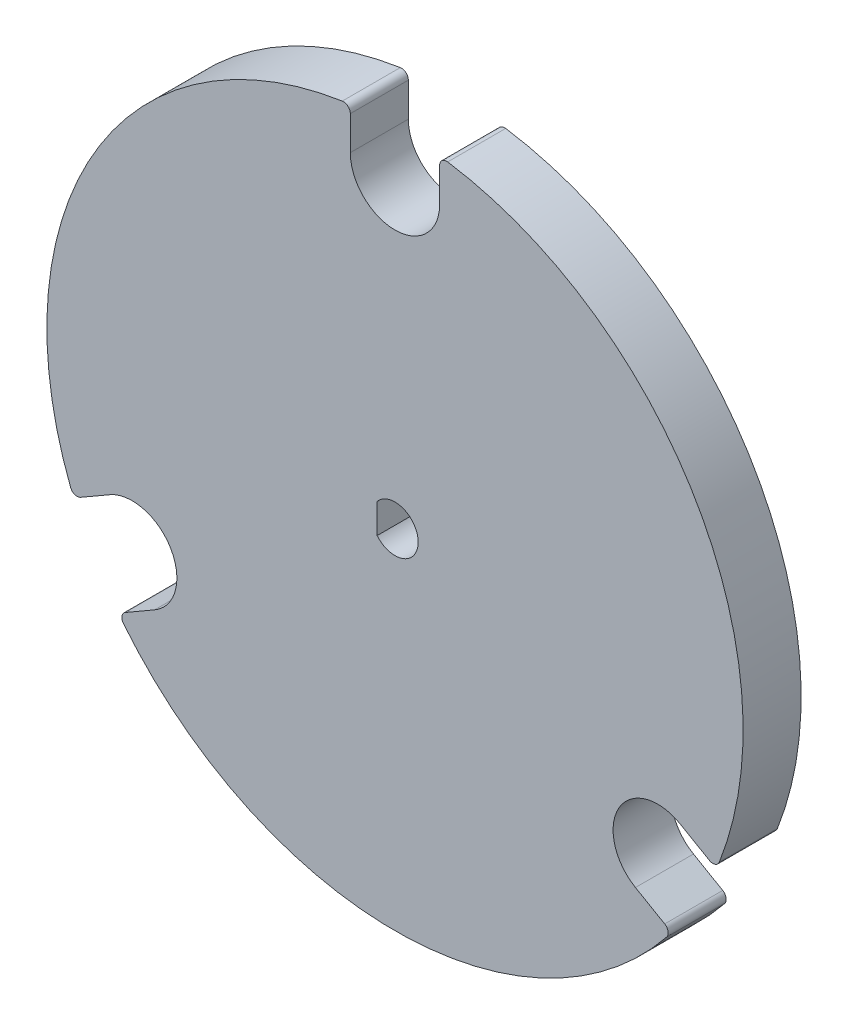
ISO-10303-21;
HEADER;
FILE_DESCRIPTION(('STEP AP214'),'2;1');
FILE_NAME('part.step','',(''),(''),'','','');
FILE_SCHEMA(('AUTOMOTIVE_DESIGN { 1 0 10303 214 1 1 1 1 }'));
ENDSEC;
DATA;
#1=APPLICATION_CONTEXT('core data for automotive mechanical design processes');
#2=APPLICATION_PROTOCOL_DEFINITION('international standard','automotive_design',2000,#1);
#3=PRODUCT_CONTEXT('',#1,'mechanical');
#4=PRODUCT('Part','Part','',(#3));
#5=PRODUCT_RELATED_PRODUCT_CATEGORY('part','',(#4));
#6=PRODUCT_DEFINITION_FORMATION('','',#4);
#7=PRODUCT_DEFINITION_CONTEXT('part definition',#1,'design');
#8=PRODUCT_DEFINITION('design','',#6,#7);
#9=PRODUCT_DEFINITION_SHAPE('','',#8);
#10=(LENGTH_UNIT() NAMED_UNIT(*) SI_UNIT(.MILLI.,.METRE.));
#11=(NAMED_UNIT(*) PLANE_ANGLE_UNIT() SI_UNIT($,.RADIAN.));
#12=(NAMED_UNIT(*) SI_UNIT($,.STERADIAN.) SOLID_ANGLE_UNIT());
#13=UNCERTAINTY_MEASURE_WITH_UNIT(LENGTH_MEASURE(1.E-05),#10,'distance_accuracy_value','');
#14=(GEOMETRIC_REPRESENTATION_CONTEXT(3) GLOBAL_UNCERTAINTY_ASSIGNED_CONTEXT((#13)) GLOBAL_UNIT_ASSIGNED_CONTEXT((#10,
#11,#12)) REPRESENTATION_CONTEXT('',''));
#15=CARTESIAN_POINT('',(0.,0.,0.));
#16=DIRECTION('',(0.,0.,1.));
#17=DIRECTION('',(1.,0.,0.));
#18=AXIS2_PLACEMENT_3D('',#15,#16,#17);
#19=CARTESIAN_POINT('',(0.,0.,6.35));
#20=DIRECTION('',(0.,0.,-1.));
#21=DIRECTION('',(-1.,0.,0.));
#22=AXIS2_PLACEMENT_3D('',#19,#20,#21);
#23=CYLINDRICAL_SURFACE('',#22,38.1);
#24=CARTESIAN_POINT('',(0.,0.,6.35));
#25=DIRECTION('',(0.,0.,1.));
#26=DIRECTION('',(1.,0.,0.));
#27=AXIS2_PLACEMENT_3D('',#24,#25,#26);
#28=CIRCLE('',#27,38.1);
#29=CARTESIAN_POINT('',(-5.76683673469387,37.6610354886239,6.35));
#30=VERTEX_POINT('',#29);
#31=CARTESIAN_POINT('',(-35.4988318333225,-13.8362906325897,6.35));
#32=VERTEX_POINT('',#31);
#33=EDGE_CURVE('E294',#30,#32,#28,.T.);
#34=ORIENTED_EDGE('',*,*,#33,.F.);
#35=DIRECTION('',(0.,0.,-1.));
#36=VECTOR('',#35,1.);
#37=CARTESIAN_POINT('',(-5.76683673469387,37.6610354886239,6.35));
#38=LINE('',#37,#36);
#39=CARTESIAN_POINT('',(-5.76683673469387,37.6610354886239,0.));
#40=VERTEX_POINT('',#39);
#41=EDGE_CURVE('E325',#30,#40,#38,.T.);
#42=ORIENTED_EDGE('',*,*,#41,.T.);
#43=CARTESIAN_POINT('',(0.,0.,0.));
#44=DIRECTION('',(0.,0.,1.));
#45=DIRECTION('',(1.,0.,0.));
#46=AXIS2_PLACEMENT_3D('',#43,#44,#45);
#47=CIRCLE('',#46,38.1);
#48=CARTESIAN_POINT('',(-35.4988318333225,-13.8362906325897,0.));
#49=VERTEX_POINT('',#48);
#50=EDGE_CURVE('E293',#40,#49,#47,.T.);
#51=ORIENTED_EDGE('',*,*,#50,.T.);
#52=DIRECTION('',(0.,0.,-1.));
#53=VECTOR('',#52,1.);
#54=CARTESIAN_POINT('',(-35.4988318333225,-13.8362906325897,6.35));
#55=LINE('',#54,#53);
#56=EDGE_CURVE('E321',#49,#32,#55,.F.);
#57=ORIENTED_EDGE('',*,*,#56,.T.);
#58=EDGE_LOOP('',(#34,#42,#51,#57));
#59=FACE_BOUND('',#58,.T.);
#60=ADVANCED_FACE('F39',(#59),#23,.T.);
#61=CARTESIAN_POINT('',(35.4988318333225,-13.8362906325897,0.));
#62=VERTEX_POINT('',#61);
#63=CARTESIAN_POINT('',(5.76683673469391,37.6610354886239,0.));
#64=VERTEX_POINT('',#63);
#65=EDGE_CURVE('E229',#62,#64,#47,.T.);
#66=ORIENTED_EDGE('',*,*,#65,.T.);
#67=DIRECTION('',(0.,0.,-1.));
#68=VECTOR('',#67,1.);
#69=CARTESIAN_POINT('',(5.76683673469391,37.6610354886239,6.35));
#70=LINE('',#69,#68);
#71=CARTESIAN_POINT('',(5.76683673469391,37.6610354886239,6.35));
#72=VERTEX_POINT('',#71);
#73=EDGE_CURVE('E349',#64,#72,#70,.F.);
#74=ORIENTED_EDGE('',*,*,#73,.T.);
#75=CARTESIAN_POINT('',(35.4988318333225,-13.8362906325897,6.35));
#76=VERTEX_POINT('',#75);
#77=EDGE_CURVE('E288',#76,#72,#28,.T.);
#78=ORIENTED_EDGE('',*,*,#77,.F.);
#79=DIRECTION('',(0.,0.,-1.));
#80=VECTOR('',#79,1.);
#81=CARTESIAN_POINT('',(35.4988318333225,-13.8362906325897,6.35));
#82=LINE('',#81,#80);
#83=EDGE_CURVE('E346',#76,#62,#82,.T.);
#84=ORIENTED_EDGE('',*,*,#83,.T.);
#85=EDGE_LOOP('',(#66,#74,#78,#84));
#86=FACE_BOUND('',#85,.T.);
#87=ADVANCED_FACE('F423',(#86),#23,.T.);
#88=CARTESIAN_POINT('',(-29.7319950986286,-23.8247448560341,6.35));
#89=VERTEX_POINT('',#88);
#90=CARTESIAN_POINT('',(29.7319950986286,-23.8247448560341,6.35));
#91=VERTEX_POINT('',#90);
#92=EDGE_CURVE('E292',#89,#91,#28,.T.);
#93=ORIENTED_EDGE('',*,*,#92,.F.);
#94=DIRECTION('',(0.,0.,-1.));
#95=VECTOR('',#94,1.);
#96=CARTESIAN_POINT('',(-29.7319950986286,-23.8247448560341,6.35));
#97=LINE('',#96,#95);
#98=CARTESIAN_POINT('',(-29.7319950986286,-23.8247448560341,0.));
#99=VERTEX_POINT('',#98);
#100=EDGE_CURVE('E364',#89,#99,#97,.T.);
#101=ORIENTED_EDGE('',*,*,#100,.T.);
#102=CARTESIAN_POINT('',(29.7319950986286,-23.8247448560341,0.));
#103=VERTEX_POINT('',#102);
#104=EDGE_CURVE('E295',#99,#103,#47,.T.);
#105=ORIENTED_EDGE('',*,*,#104,.T.);
#106=DIRECTION('',(0.,0.,-1.));
#107=VECTOR('',#106,1.);
#108=CARTESIAN_POINT('',(29.7319950986286,-23.8247448560341,6.35));
#109=LINE('',#108,#107);
#110=EDGE_CURVE('E360',#103,#91,#109,.F.);
#111=ORIENTED_EDGE('',*,*,#110,.T.);
#112=EDGE_LOOP('',(#93,#101,#105,#111));
#113=FACE_BOUND('',#112,.T.);
#114=ADVANCED_FACE('F385',(#113),#23,.T.);
#115=CARTESIAN_POINT('',(0.,0.,6.35));
#116=DIRECTION('',(0.,0.,1.));
#117=DIRECTION('',(1.,0.,0.));
#118=AXIS2_PLACEMENT_3D('',#115,#116,#117);
#119=PLANE('',#118);
#120=CARTESIAN_POINT('',(0.,0.,6.35));
#121=DIRECTION('',(0.,0.,1.));
#122=DIRECTION('',(1.,0.,0.));
#123=AXIS2_PLACEMENT_3D('',#120,#121,#122);
#124=CIRCLE('',#123,2.54);
#125=CARTESIAN_POINT('',(-1.9558,-1.62063146952045,6.35));
#126=VERTEX_POINT('',#125);
#127=CARTESIAN_POINT('',(-1.9558,1.62063146952045,6.35));
#128=VERTEX_POINT('',#127);
#129=EDGE_CURVE('E55',#126,#128,#124,.T.);
#130=ORIENTED_EDGE('',*,*,#129,.F.);
#131=DIRECTION('',(0.,-1.,0.));
#132=VECTOR('',#131,1.);
#133=CARTESIAN_POINT('',(-1.9558,-1.62063146952045,6.35));
#134=LINE('',#133,#132);
#135=EDGE_CURVE('E191',#128,#126,#134,.T.);
#136=ORIENTED_EDGE('',*,*,#135,.F.);
#137=EDGE_LOOP('',(#130,#136));
#138=FACE_BOUND('',#137,.T.);
#139=DIRECTION('',(0.,-1.,0.));
#140=VECTOR('',#139,1.);
#141=CARTESIAN_POINT('',(-4.88949999999999,33.2105,6.35));
#142=LINE('',#141,#140);
#143=CARTESIAN_POINT('',(-4.88949999999999,36.9078147788514,6.35));
#144=VERTEX_POINT('',#143);
#145=CARTESIAN_POINT('',(-4.88949999999999,33.2105,6.35));
#146=VERTEX_POINT('',#145);
#147=EDGE_CURVE('E206',#144,#146,#142,.T.);
#148=ORIENTED_EDGE('',*,*,#147,.F.);
#149=CARTESIAN_POINT('',(-5.65149999999999,36.9078147788514,6.35));
#150=DIRECTION('',(0.,0.,1.));
#151=DIRECTION('',(1.,0.,0.));
#152=AXIS2_PLACEMENT_3D('',#149,#150,#151);
#153=CIRCLE('',#152,0.762);
#154=EDGE_CURVE('E318',#144,#30,#153,.T.);
#155=ORIENTED_EDGE('',*,*,#154,.T.);
#156=ORIENTED_EDGE('',*,*,#33,.T.);
#157=CARTESIAN_POINT('',(-34.788855196656,-13.5595648199379,6.35));
#158=DIRECTION('',(0.,0.,1.));
#159=DIRECTION('',(1.,0.,0.));
#160=AXIS2_PLACEMENT_3D('',#157,#158,#159);
#161=CIRCLE('',#160,0.762);
#162=CARTESIAN_POINT('',(-34.407855196656,-14.2194761776217,6.35));
#163=VERTEX_POINT('',#162);
#164=EDGE_CURVE('E309',#32,#163,#161,.T.);
#165=ORIENTED_EDGE('',*,*,#164,.T.);
#166=DIRECTION('',(-0.866025403784438,-0.500000000000001,0.));
#167=VECTOR('',#166,1.);
#168=CARTESIAN_POINT('',(-31.2058866723831,-12.370818788196,6.35));
#169=LINE('',#168,#167);
#170=CARTESIAN_POINT('',(-31.2058866723831,-12.370818788196,6.35));
#171=VERTEX_POINT('',#170);
#172=EDGE_CURVE('E277',#171,#163,#169,.T.);
#173=ORIENTED_EDGE('',*,*,#172,.F.);
#174=CARTESIAN_POINT('',(-28.7611366723831,-16.60525,6.35));
#175=DIRECTION('',(0.,0.,1.));
#176=DIRECTION('',(1.,0.,0.));
#177=AXIS2_PLACEMENT_3D('',#174,#175,#176);
#178=CIRCLE('',#177,4.88950000000001);
#179=CARTESIAN_POINT('',(-26.3163866723831,-20.839681211804,6.35));
#180=VERTEX_POINT('',#179);
#181=EDGE_CURVE('E199',#180,#171,#178,.T.);
#182=ORIENTED_EDGE('',*,*,#181,.F.);
#183=DIRECTION('',(0.866025403784439,0.5,0.));
#184=VECTOR('',#183,1.);
#185=CARTESIAN_POINT('',(-26.3163866723831,-20.839681211804,6.35));
#186=LINE('',#185,#184);
#187=CARTESIAN_POINT('',(-29.518355196656,-22.6883386012297,6.35));
#188=VERTEX_POINT('',#187);
#189=EDGE_CURVE('E266',#188,#180,#186,.T.);
#190=ORIENTED_EDGE('',*,*,#189,.F.);
#191=CARTESIAN_POINT('',(-29.137355196656,-23.3482499589134,6.35));
#192=DIRECTION('',(0.,0.,1.));
#193=DIRECTION('',(1.,0.,0.));
#194=AXIS2_PLACEMENT_3D('',#191,#192,#193);
#195=CIRCLE('',#194,0.762);
#196=EDGE_CURVE('E312',#188,#89,#195,.T.);
#197=ORIENTED_EDGE('',*,*,#196,.T.);
#198=ORIENTED_EDGE('',*,*,#92,.T.);
#199=CARTESIAN_POINT('',(29.137355196656,-23.3482499589135,6.35));
#200=DIRECTION('',(0.,0.,1.));
#201=DIRECTION('',(1.,0.,0.));
#202=AXIS2_PLACEMENT_3D('',#199,#200,#201);
#203=CIRCLE('',#202,0.762);
#204=CARTESIAN_POINT('',(29.518355196656,-22.6883386012297,6.35));
#205=VERTEX_POINT('',#204);
#206=EDGE_CURVE('E306',#91,#205,#203,.T.);
#207=ORIENTED_EDGE('',*,*,#206,.T.);
#208=DIRECTION('',(0.866025403784439,-0.499999999999999,0.));
#209=VECTOR('',#208,1.);
#210=CARTESIAN_POINT('',(26.3163866723831,-20.839681211804,6.35));
#211=LINE('',#210,#209);
#212=CARTESIAN_POINT('',(26.3163866723831,-20.839681211804,6.35));
#213=VERTEX_POINT('',#212);
#214=EDGE_CURVE('E249',#213,#205,#211,.T.);
#215=ORIENTED_EDGE('',*,*,#214,.F.);
#216=CARTESIAN_POINT('',(28.7611366723831,-16.60525,6.35));
#217=DIRECTION('',(0.,0.,1.));
#218=DIRECTION('',(1.,0.,0.));
#219=AXIS2_PLACEMENT_3D('',#216,#217,#218);
#220=CIRCLE('',#219,4.88950000000001);
#221=CARTESIAN_POINT('',(31.2058866723831,-12.370818788196,6.35));
#222=VERTEX_POINT('',#221);
#223=EDGE_CURVE('E245',#222,#213,#220,.T.);
#224=ORIENTED_EDGE('',*,*,#223,.F.);
#225=DIRECTION('',(-0.866025403784439,0.499999999999999,0.));
#226=VECTOR('',#225,1.);
#227=CARTESIAN_POINT('',(31.2058866723831,-12.370818788196,6.35));
#228=LINE('',#227,#226);
#229=CARTESIAN_POINT('',(34.407855196656,-14.2194761776217,6.35));
#230=VERTEX_POINT('',#229);
#231=EDGE_CURVE('E237',#230,#222,#228,.T.);
#232=ORIENTED_EDGE('',*,*,#231,.F.);
#233=CARTESIAN_POINT('',(34.788855196656,-13.5595648199379,6.35));
#234=DIRECTION('',(0.,0.,1.));
#235=DIRECTION('',(1.,0.,0.));
#236=AXIS2_PLACEMENT_3D('',#233,#234,#235);
#237=CIRCLE('',#236,0.762);
#238=EDGE_CURVE('E303',#230,#76,#237,.T.);
#239=ORIENTED_EDGE('',*,*,#238,.T.);
#240=ORIENTED_EDGE('',*,*,#77,.T.);
#241=CARTESIAN_POINT('',(5.65150000000003,36.9078147788514,6.35));
#242=DIRECTION('',(0.,0.,1.));
#243=DIRECTION('',(1.,0.,0.));
#244=AXIS2_PLACEMENT_3D('',#241,#242,#243);
#245=CIRCLE('',#244,0.762);
#246=CARTESIAN_POINT('',(4.88950000000003,36.9078147788514,6.35));
#247=VERTEX_POINT('',#246);
#248=EDGE_CURVE('E315',#72,#247,#245,.T.);
#249=ORIENTED_EDGE('',*,*,#248,.T.);
#250=DIRECTION('',(0.,1.,0.));
#251=VECTOR('',#250,1.);
#252=CARTESIAN_POINT('',(4.88950000000003,33.2105,6.35));
#253=LINE('',#252,#251);
#254=CARTESIAN_POINT('',(4.88950000000003,33.2105,6.35));
#255=VERTEX_POINT('',#254);
#256=EDGE_CURVE('E218',#255,#247,#253,.T.);
#257=ORIENTED_EDGE('',*,*,#256,.F.);
#258=CARTESIAN_POINT('',(0.,33.2105,6.35));
#259=DIRECTION('',(0.,0.,1.));
#260=DIRECTION('',(1.,0.,0.));
#261=AXIS2_PLACEMENT_3D('',#258,#259,#260);
#262=CIRCLE('',#261,4.88950000000001);
#263=EDGE_CURVE('E214',#146,#255,#262,.T.);
#264=ORIENTED_EDGE('',*,*,#263,.F.);
#265=EDGE_LOOP('',(#148,#155,#156,#165,#173,#182,#190,#197,#198,#207,#215,#224,#232,#239,#240,
#249,#257,#264));
#266=FACE_BOUND('',#265,.T.);
#267=ADVANCED_FACE('F389',(#138,#266),#119,.T.);
#268=CARTESIAN_POINT('',(0.,0.,0.));
#269=DIRECTION('',(0.,0.,1.));
#270=DIRECTION('',(1.,0.,0.));
#271=AXIS2_PLACEMENT_3D('',#268,#269,#270);
#272=PLANE('',#271);
#273=DIRECTION('',(0.,-1.,0.));
#274=VECTOR('',#273,1.);
#275=CARTESIAN_POINT('',(-1.9558,-1.62063146952045,0.));
#276=LINE('',#275,#274);
#277=CARTESIAN_POINT('',(-1.9558,1.62063146952045,0.));
#278=VERTEX_POINT('',#277);
#279=CARTESIAN_POINT('',(-1.9558,-1.62063146952045,0.));
#280=VERTEX_POINT('',#279);
#281=EDGE_CURVE('E181',#278,#280,#276,.T.);
#282=ORIENTED_EDGE('',*,*,#281,.T.);
#283=CARTESIAN_POINT('',(0.,0.,0.));
#284=DIRECTION('',(0.,0.,1.));
#285=DIRECTION('',(1.,0.,0.));
#286=AXIS2_PLACEMENT_3D('',#283,#284,#285);
#287=CIRCLE('',#286,2.54);
#288=EDGE_CURVE('E60',#280,#278,#287,.T.);
#289=ORIENTED_EDGE('',*,*,#288,.T.);
#290=EDGE_LOOP('',(#282,#289));
#291=FACE_BOUND('',#290,.T.);
#292=ORIENTED_EDGE('',*,*,#50,.F.);
#293=CARTESIAN_POINT('',(-5.65149999999999,36.9078147788514,0.));
#294=DIRECTION('',(0.,0.,1.));
#295=DIRECTION('',(1.,0.,0.));
#296=AXIS2_PLACEMENT_3D('',#293,#294,#295);
#297=CIRCLE('',#296,0.762);
#298=CARTESIAN_POINT('',(-4.88949999999999,36.9078147788514,0.));
#299=VERTEX_POINT('',#298);
#300=EDGE_CURVE('E343',#40,#299,#297,.F.);
#301=ORIENTED_EDGE('',*,*,#300,.T.);
#302=DIRECTION('',(0.,-1.,0.));
#303=VECTOR('',#302,1.);
#304=CARTESIAN_POINT('',(-4.88949999999999,33.2105,0.));
#305=LINE('',#304,#303);
#306=CARTESIAN_POINT('',(-4.88949999999999,33.2105,0.));
#307=VERTEX_POINT('',#306);
#308=EDGE_CURVE('E210',#299,#307,#305,.T.);
#309=ORIENTED_EDGE('',*,*,#308,.T.);
#310=CARTESIAN_POINT('',(0.,33.2105,0.));
#311=DIRECTION('',(0.,0.,1.));
#312=DIRECTION('',(1.,0.,0.));
#313=AXIS2_PLACEMENT_3D('',#310,#311,#312);
#314=CIRCLE('',#313,4.88950000000001);
#315=CARTESIAN_POINT('',(4.88950000000003,33.2105,0.));
#316=VERTEX_POINT('',#315);
#317=EDGE_CURVE('E201',#307,#316,#314,.T.);
#318=ORIENTED_EDGE('',*,*,#317,.T.);
#319=DIRECTION('',(0.,1.,0.));
#320=VECTOR('',#319,1.);
#321=CARTESIAN_POINT('',(4.88950000000003,33.2105,0.));
#322=LINE('',#321,#320);
#323=CARTESIAN_POINT('',(4.88950000000003,36.9078147788514,0.));
#324=VERTEX_POINT('',#323);
#325=EDGE_CURVE('E205',#316,#324,#322,.T.);
#326=ORIENTED_EDGE('',*,*,#325,.T.);
#327=CARTESIAN_POINT('',(5.65150000000003,36.9078147788514,0.));
#328=DIRECTION('',(0.,0.,1.));
#329=DIRECTION('',(1.,0.,0.));
#330=AXIS2_PLACEMENT_3D('',#327,#328,#329);
#331=CIRCLE('',#330,0.762);
#332=EDGE_CURVE('E340',#324,#64,#331,.F.);
#333=ORIENTED_EDGE('',*,*,#332,.T.);
#334=ORIENTED_EDGE('',*,*,#65,.F.);
#335=CARTESIAN_POINT('',(34.788855196656,-13.5595648199379,0.));
#336=DIRECTION('',(0.,0.,1.));
#337=DIRECTION('',(1.,0.,0.));
#338=AXIS2_PLACEMENT_3D('',#335,#336,#337);
#339=CIRCLE('',#338,0.762);
#340=CARTESIAN_POINT('',(34.407855196656,-14.2194761776217,0.));
#341=VERTEX_POINT('',#340);
#342=EDGE_CURVE('E328',#62,#341,#339,.F.);
#343=ORIENTED_EDGE('',*,*,#342,.T.);
#344=DIRECTION('',(-0.866025403784439,0.499999999999999,0.));
#345=VECTOR('',#344,1.);
#346=CARTESIAN_POINT('',(31.2058866723831,-12.370818788196,0.));
#347=LINE('',#346,#345);
#348=CARTESIAN_POINT('',(31.2058866723831,-12.370818788196,0.));
#349=VERTEX_POINT('',#348);
#350=EDGE_CURVE('E241',#341,#349,#347,.T.);
#351=ORIENTED_EDGE('',*,*,#350,.T.);
#352=CARTESIAN_POINT('',(28.7611366723831,-16.60525,0.));
#353=DIRECTION('',(0.,0.,1.));
#354=DIRECTION('',(1.,0.,0.));
#355=AXIS2_PLACEMENT_3D('',#352,#353,#354);
#356=CIRCLE('',#355,4.88950000000001);
#357=CARTESIAN_POINT('',(26.3163866723831,-20.839681211804,0.));
#358=VERTEX_POINT('',#357);
#359=EDGE_CURVE('E232',#349,#358,#356,.T.);
#360=ORIENTED_EDGE('',*,*,#359,.T.);
#361=DIRECTION('',(0.866025403784439,-0.499999999999999,0.));
#362=VECTOR('',#361,1.);
#363=CARTESIAN_POINT('',(26.3163866723831,-20.839681211804,0.));
#364=LINE('',#363,#362);
#365=CARTESIAN_POINT('',(29.518355196656,-22.6883386012297,0.));
#366=VERTEX_POINT('',#365);
#367=EDGE_CURVE('E236',#358,#366,#364,.T.);
#368=ORIENTED_EDGE('',*,*,#367,.T.);
#369=CARTESIAN_POINT('',(29.137355196656,-23.3482499589135,0.));
#370=DIRECTION('',(0.,0.,1.));
#371=DIRECTION('',(1.,0.,0.));
#372=AXIS2_PLACEMENT_3D('',#369,#370,#371);
#373=CIRCLE('',#372,0.762);
#374=EDGE_CURVE('E331',#366,#103,#373,.F.);
#375=ORIENTED_EDGE('',*,*,#374,.T.);
#376=ORIENTED_EDGE('',*,*,#104,.F.);
#377=CARTESIAN_POINT('',(-29.137355196656,-23.3482499589134,0.));
#378=DIRECTION('',(0.,0.,1.));
#379=DIRECTION('',(1.,0.,0.));
#380=AXIS2_PLACEMENT_3D('',#377,#378,#379);
#381=CIRCLE('',#380,0.762);
#382=CARTESIAN_POINT('',(-29.518355196656,-22.6883386012297,0.));
#383=VERTEX_POINT('',#382);
#384=EDGE_CURVE('E337',#99,#383,#381,.F.);
#385=ORIENTED_EDGE('',*,*,#384,.T.);
#386=DIRECTION('',(0.866025403784439,0.5,0.));
#387=VECTOR('',#386,1.);
#388=CARTESIAN_POINT('',(-26.3163866723831,-20.839681211804,0.));
#389=LINE('',#388,#387);
#390=CARTESIAN_POINT('',(-26.3163866723831,-20.839681211804,0.));
#391=VERTEX_POINT('',#390);
#392=EDGE_CURVE('E270',#383,#391,#389,.T.);
#393=ORIENTED_EDGE('',*,*,#392,.T.);
#394=CARTESIAN_POINT('',(-28.7611366723831,-16.60525,0.));
#395=DIRECTION('',(0.,0.,1.));
#396=DIRECTION('',(1.,0.,0.));
#397=AXIS2_PLACEMENT_3D('',#394,#395,#396);
#398=CIRCLE('',#397,4.88950000000001);
#399=CARTESIAN_POINT('',(-31.2058866723831,-12.370818788196,0.));
#400=VERTEX_POINT('',#399);
#401=EDGE_CURVE('E261',#391,#400,#398,.T.);
#402=ORIENTED_EDGE('',*,*,#401,.T.);
#403=DIRECTION('',(-0.866025403784438,-0.500000000000001,0.));
#404=VECTOR('',#403,1.);
#405=CARTESIAN_POINT('',(-31.2058866723831,-12.370818788196,0.));
#406=LINE('',#405,#404);
#407=CARTESIAN_POINT('',(-34.407855196656,-14.2194761776217,0.));
#408=VERTEX_POINT('',#407);
#409=EDGE_CURVE('E265',#400,#408,#406,.T.);
#410=ORIENTED_EDGE('',*,*,#409,.T.);
#411=CARTESIAN_POINT('',(-34.788855196656,-13.5595648199379,0.));
#412=DIRECTION('',(0.,0.,1.));
#413=DIRECTION('',(1.,0.,0.));
#414=AXIS2_PLACEMENT_3D('',#411,#412,#413);
#415=CIRCLE('',#414,0.762);
#416=EDGE_CURVE('E334',#408,#49,#415,.F.);
#417=ORIENTED_EDGE('',*,*,#416,.T.);
#418=EDGE_LOOP('',(#292,#301,#309,#318,#326,#333,#334,#343,#351,#360,#368,#375,#376,#385,#393,
#402,#410,#417));
#419=FACE_BOUND('',#418,.T.);
#420=ADVANCED_FACE('F188',(#291,#419),#272,.F.);
#421=CARTESIAN_POINT('',(-28.7611366723831,-16.60525,0.));
#422=DIRECTION('',(0.,0.,1.));
#423=DIRECTION('',(1.,0.,0.));
#424=AXIS2_PLACEMENT_3D('',#421,#422,#423);
#425=CYLINDRICAL_SURFACE('',#424,4.88950000000001);
#426=ORIENTED_EDGE('',*,*,#181,.T.);
#427=DIRECTION('',(0.,0.,1.));
#428=VECTOR('',#427,1.);
#429=CARTESIAN_POINT('',(-31.2058866723831,-12.370818788196,0.));
#430=LINE('',#429,#428);
#431=EDGE_CURVE('E273',#400,#171,#430,.T.);
#432=ORIENTED_EDGE('',*,*,#431,.F.);
#433=ORIENTED_EDGE('',*,*,#401,.F.);
#434=DIRECTION('',(0.,0.,1.));
#435=VECTOR('',#434,1.);
#436=CARTESIAN_POINT('',(-26.3163866723831,-20.839681211804,0.));
#437=LINE('',#436,#435);
#438=EDGE_CURVE('E250',#391,#180,#437,.T.);
#439=ORIENTED_EDGE('',*,*,#438,.T.);
#440=EDGE_LOOP('',(#426,#432,#433,#439));
#441=FACE_BOUND('',#440,.T.);
#442=ADVANCED_FACE('F448',(#441),#425,.F.);
#443=CARTESIAN_POINT('',(-26.3163866723831,-20.839681211804,0.));
#444=DIRECTION('',(0.5,-0.866025403784439,0.));
#445=DIRECTION('',(0.866025403784439,0.5,0.));
#446=AXIS2_PLACEMENT_3D('',#443,#444,#445);
#447=PLANE('',#446);
#448=ORIENTED_EDGE('',*,*,#392,.F.);
#449=DIRECTION('',(0.,0.,-1.));
#450=VECTOR('',#449,1.);
#451=CARTESIAN_POINT('',(-29.518355196656,-22.6883386012297,0.));
#452=LINE('',#451,#450);
#453=EDGE_CURVE('E356',#383,#188,#452,.F.);
#454=ORIENTED_EDGE('',*,*,#453,.T.);
#455=ORIENTED_EDGE('',*,*,#189,.T.);
#456=ORIENTED_EDGE('',*,*,#438,.F.);
#457=EDGE_LOOP('',(#448,#454,#455,#456));
#458=FACE_BOUND('',#457,.T.);
#459=ADVANCED_FACE('F451',(#458),#447,.F.);
#460=CARTESIAN_POINT('',(-31.2058866723831,-12.370818788196,0.));
#461=DIRECTION('',(-0.500000000000001,0.866025403784438,0.));
#462=DIRECTION('',(-0.866025403784438,-0.500000000000001,0.));
#463=AXIS2_PLACEMENT_3D('',#460,#461,#462);
#464=PLANE('',#463);
#465=ORIENTED_EDGE('',*,*,#172,.T.);
#466=DIRECTION('',(0.,0.,-1.));
#467=VECTOR('',#466,1.);
#468=CARTESIAN_POINT('',(-34.407855196656,-14.2194761776217,0.));
#469=LINE('',#468,#467);
#470=EDGE_CURVE('E367',#163,#408,#469,.T.);
#471=ORIENTED_EDGE('',*,*,#470,.T.);
#472=ORIENTED_EDGE('',*,*,#409,.F.);
#473=ORIENTED_EDGE('',*,*,#431,.T.);
#474=EDGE_LOOP('',(#465,#471,#472,#473));
#475=FACE_BOUND('',#474,.T.);
#476=ADVANCED_FACE('F443',(#475),#464,.F.);
#477=CARTESIAN_POINT('',(28.7611366723831,-16.60525,0.));
#478=DIRECTION('',(0.,0.,1.));
#479=DIRECTION('',(1.,0.,0.));
#480=AXIS2_PLACEMENT_3D('',#477,#478,#479);
#481=CYLINDRICAL_SURFACE('',#480,4.88950000000001);
#482=ORIENTED_EDGE('',*,*,#223,.T.);
#483=DIRECTION('',(0.,0.,1.));
#484=VECTOR('',#483,1.);
#485=CARTESIAN_POINT('',(26.3163866723831,-20.839681211804,0.));
#486=LINE('',#485,#484);
#487=EDGE_CURVE('E244',#358,#213,#486,.T.);
#488=ORIENTED_EDGE('',*,*,#487,.F.);
#489=ORIENTED_EDGE('',*,*,#359,.F.);
#490=DIRECTION('',(0.,0.,1.));
#491=VECTOR('',#490,1.);
#492=CARTESIAN_POINT('',(31.2058866723831,-12.370818788196,0.));
#493=LINE('',#492,#491);
#494=EDGE_CURVE('E219',#349,#222,#493,.T.);
#495=ORIENTED_EDGE('',*,*,#494,.T.);
#496=EDGE_LOOP('',(#482,#488,#489,#495));
#497=FACE_BOUND('',#496,.T.);
#498=ADVANCED_FACE('F485',(#497),#481,.F.);
#499=CARTESIAN_POINT('',(31.2058866723831,-12.370818788196,0.));
#500=DIRECTION('',(0.499999999999999,0.866025403784439,0.));
#501=DIRECTION('',(-0.86602540378444,0.499999999999999,0.));
#502=AXIS2_PLACEMENT_3D('',#499,#500,#501);
#503=PLANE('',#502);
#504=ORIENTED_EDGE('',*,*,#350,.F.);
#505=DIRECTION('',(0.,0.,-1.));
#506=VECTOR('',#505,1.);
#507=CARTESIAN_POINT('',(34.407855196656,-14.2194761776217,0.));
#508=LINE('',#507,#506);
#509=EDGE_CURVE('E11',#341,#230,#508,.F.);
#510=ORIENTED_EDGE('',*,*,#509,.T.);
#511=ORIENTED_EDGE('',*,*,#231,.T.);
#512=ORIENTED_EDGE('',*,*,#494,.F.);
#513=EDGE_LOOP('',(#504,#510,#511,#512));
#514=FACE_BOUND('',#513,.T.);
#515=ADVANCED_FACE('F433',(#514),#503,.F.);
#516=CARTESIAN_POINT('',(26.3163866723831,-20.839681211804,0.));
#517=DIRECTION('',(-0.499999999999999,-0.866025403784439,0.));
#518=DIRECTION('',(0.866025403784439,-0.499999999999999,0.));
#519=AXIS2_PLACEMENT_3D('',#516,#517,#518);
#520=PLANE('',#519);
#521=ORIENTED_EDGE('',*,*,#214,.T.);
#522=DIRECTION('',(0.,0.,-1.));
#523=VECTOR('',#522,1.);
#524=CARTESIAN_POINT('',(29.518355196656,-22.6883386012297,0.));
#525=LINE('',#524,#523);
#526=EDGE_CURVE('E48',#205,#366,#525,.T.);
#527=ORIENTED_EDGE('',*,*,#526,.T.);
#528=ORIENTED_EDGE('',*,*,#367,.F.);
#529=ORIENTED_EDGE('',*,*,#487,.T.);
#530=EDGE_LOOP('',(#521,#527,#528,#529));
#531=FACE_BOUND('',#530,.T.);
#532=ADVANCED_FACE('F373',(#531),#520,.F.);
#533=CARTESIAN_POINT('',(0.,33.2105,0.));
#534=DIRECTION('',(0.,0.,1.));
#535=DIRECTION('',(1.,0.,0.));
#536=AXIS2_PLACEMENT_3D('',#533,#534,#535);
#537=CYLINDRICAL_SURFACE('',#536,4.88950000000001);
#538=ORIENTED_EDGE('',*,*,#263,.T.);
#539=DIRECTION('',(0.,0.,1.));
#540=VECTOR('',#539,1.);
#541=CARTESIAN_POINT('',(4.88950000000003,33.2105,0.));
#542=LINE('',#541,#540);
#543=EDGE_CURVE('E213',#316,#255,#542,.T.);
#544=ORIENTED_EDGE('',*,*,#543,.F.);
#545=ORIENTED_EDGE('',*,*,#317,.F.);
#546=DIRECTION('',(0.,0.,1.));
#547=VECTOR('',#546,1.);
#548=CARTESIAN_POINT('',(-4.88949999999999,33.2105,0.));
#549=LINE('',#548,#547);
#550=EDGE_CURVE('E225',#307,#146,#549,.T.);
#551=ORIENTED_EDGE('',*,*,#550,.T.);
#552=EDGE_LOOP('',(#538,#544,#545,#551));
#553=FACE_BOUND('',#552,.T.);
#554=ADVANCED_FACE('F411',(#553),#537,.F.);
#555=CARTESIAN_POINT('',(-4.88949999999999,33.2105,0.));
#556=DIRECTION('',(-1.,0.,0.));
#557=DIRECTION('',(0.,-1.,0.));
#558=AXIS2_PLACEMENT_3D('',#555,#556,#557);
#559=PLANE('',#558);
#560=ORIENTED_EDGE('',*,*,#308,.F.);
#561=DIRECTION('',(0.,0.,-1.));
#562=VECTOR('',#561,1.);
#563=CARTESIAN_POINT('',(-4.88949999999999,36.9078147788514,0.));
#564=LINE('',#563,#562);
#565=EDGE_CURVE('E299',#299,#144,#564,.F.);
#566=ORIENTED_EDGE('',*,*,#565,.T.);
#567=ORIENTED_EDGE('',*,*,#147,.T.);
#568=ORIENTED_EDGE('',*,*,#550,.F.);
#569=EDGE_LOOP('',(#560,#566,#567,#568));
#570=FACE_BOUND('',#569,.T.);
#571=ADVANCED_FACE('F407',(#570),#559,.F.);
#572=CARTESIAN_POINT('',(4.88950000000003,33.2105,0.));
#573=DIRECTION('',(1.,0.,0.));
#574=DIRECTION('',(0.,1.,0.));
#575=AXIS2_PLACEMENT_3D('',#572,#573,#574);
#576=PLANE('',#575);
#577=ORIENTED_EDGE('',*,*,#256,.T.);
#578=DIRECTION('',(0.,0.,-1.));
#579=VECTOR('',#578,1.);
#580=CARTESIAN_POINT('',(4.88950000000003,36.9078147788514,0.));
#581=LINE('',#580,#579);
#582=EDGE_CURVE('E353',#247,#324,#581,.T.);
#583=ORIENTED_EDGE('',*,*,#582,.T.);
#584=ORIENTED_EDGE('',*,*,#325,.F.);
#585=ORIENTED_EDGE('',*,*,#543,.T.);
#586=EDGE_LOOP('',(#577,#583,#584,#585));
#587=FACE_BOUND('',#586,.T.);
#588=ADVANCED_FACE('F497',(#587),#576,.F.);
#589=CARTESIAN_POINT('',(-5.65149999999999,36.9078147788514,6.35));
#590=DIRECTION('',(0.,0.,-1.));
#591=DIRECTION('',(-1.,0.,0.));
#592=AXIS2_PLACEMENT_3D('',#589,#590,#591);
#593=CYLINDRICAL_SURFACE('',#592,0.762);
#594=ORIENTED_EDGE('',*,*,#300,.F.);
#595=ORIENTED_EDGE('',*,*,#41,.F.);
#596=ORIENTED_EDGE('',*,*,#154,.F.);
#597=ORIENTED_EDGE('',*,*,#565,.F.);
#598=EDGE_LOOP('',(#594,#595,#596,#597));
#599=FACE_BOUND('',#598,.T.);
#600=ADVANCED_FACE('F402',(#599),#593,.T.);
#601=CARTESIAN_POINT('',(5.65150000000003,36.9078147788514,6.35));
#602=DIRECTION('',(0.,0.,-1.));
#603=DIRECTION('',(-1.,0.,0.));
#604=AXIS2_PLACEMENT_3D('',#601,#602,#603);
#605=CYLINDRICAL_SURFACE('',#604,0.762);
#606=ORIENTED_EDGE('',*,*,#332,.F.);
#607=ORIENTED_EDGE('',*,*,#582,.F.);
#608=ORIENTED_EDGE('',*,*,#248,.F.);
#609=ORIENTED_EDGE('',*,*,#73,.F.);
#610=EDGE_LOOP('',(#606,#607,#608,#609));
#611=FACE_BOUND('',#610,.T.);
#612=ADVANCED_FACE('F420',(#611),#605,.T.);
#613=CARTESIAN_POINT('',(-29.137355196656,-23.3482499589134,6.35));
#614=DIRECTION('',(0.,0.,-1.));
#615=DIRECTION('',(-1.,0.,0.));
#616=AXIS2_PLACEMENT_3D('',#613,#614,#615);
#617=CYLINDRICAL_SURFACE('',#616,0.762);
#618=ORIENTED_EDGE('',*,*,#384,.F.);
#619=ORIENTED_EDGE('',*,*,#100,.F.);
#620=ORIENTED_EDGE('',*,*,#196,.F.);
#621=ORIENTED_EDGE('',*,*,#453,.F.);
#622=EDGE_LOOP('',(#618,#619,#620,#621));
#623=FACE_BOUND('',#622,.T.);
#624=ADVANCED_FACE('F455',(#623),#617,.T.);
#625=CARTESIAN_POINT('',(-34.788855196656,-13.5595648199379,6.35));
#626=DIRECTION('',(0.,0.,-1.));
#627=DIRECTION('',(-1.,0.,0.));
#628=AXIS2_PLACEMENT_3D('',#625,#626,#627);
#629=CYLINDRICAL_SURFACE('',#628,0.762);
#630=ORIENTED_EDGE('',*,*,#416,.F.);
#631=ORIENTED_EDGE('',*,*,#470,.F.);
#632=ORIENTED_EDGE('',*,*,#164,.F.);
#633=ORIENTED_EDGE('',*,*,#56,.F.);
#634=EDGE_LOOP('',(#630,#631,#632,#633));
#635=FACE_BOUND('',#634,.T.);
#636=ADVANCED_FACE('F439',(#635),#629,.T.);
#637=CARTESIAN_POINT('',(29.137355196656,-23.3482499589135,6.35));
#638=DIRECTION('',(0.,0.,-1.));
#639=DIRECTION('',(-1.,0.,0.));
#640=AXIS2_PLACEMENT_3D('',#637,#638,#639);
#641=CYLINDRICAL_SURFACE('',#640,0.762);
#642=ORIENTED_EDGE('',*,*,#374,.F.);
#643=ORIENTED_EDGE('',*,*,#526,.F.);
#644=ORIENTED_EDGE('',*,*,#206,.F.);
#645=ORIENTED_EDGE('',*,*,#110,.F.);
#646=EDGE_LOOP('',(#642,#643,#644,#645));
#647=FACE_BOUND('',#646,.T.);
#648=ADVANCED_FACE('F381',(#647),#641,.T.);
#649=CARTESIAN_POINT('',(34.788855196656,-13.5595648199379,6.35));
#650=DIRECTION('',(0.,0.,-1.));
#651=DIRECTION('',(-1.,0.,0.));
#652=AXIS2_PLACEMENT_3D('',#649,#650,#651);
#653=CYLINDRICAL_SURFACE('',#652,0.762);
#654=ORIENTED_EDGE('',*,*,#342,.F.);
#655=ORIENTED_EDGE('',*,*,#83,.F.);
#656=ORIENTED_EDGE('',*,*,#238,.F.);
#657=ORIENTED_EDGE('',*,*,#509,.F.);
#658=EDGE_LOOP('',(#654,#655,#656,#657));
#659=FACE_BOUND('',#658,.T.);
#660=ADVANCED_FACE('F41',(#659),#653,.T.);
#661=CARTESIAN_POINT('',(0.,0.,0.));
#662=DIRECTION('',(0.,0.,1.));
#663=DIRECTION('',(1.,0.,0.));
#664=AXIS2_PLACEMENT_3D('',#661,#662,#663);
#665=CYLINDRICAL_SURFACE('',#664,2.54);
#666=ORIENTED_EDGE('',*,*,#129,.T.);
#667=DIRECTION('',(0.,0.,1.));
#668=VECTOR('',#667,1.);
#669=CARTESIAN_POINT('',(-1.9558,1.62063146952045,0.));
#670=LINE('',#669,#668);
#671=EDGE_CURVE('E173',#278,#128,#670,.T.);
#672=ORIENTED_EDGE('',*,*,#671,.F.);
#673=ORIENTED_EDGE('',*,*,#288,.F.);
#674=DIRECTION('',(0.,0.,1.));
#675=VECTOR('',#674,1.);
#676=CARTESIAN_POINT('',(-1.9558,-1.62063146952045,0.));
#677=LINE('',#676,#675);
#678=EDGE_CURVE('E180',#280,#126,#677,.T.);
#679=ORIENTED_EDGE('',*,*,#678,.T.);
#680=EDGE_LOOP('',(#666,#672,#673,#679));
#681=FACE_BOUND('',#680,.T.);
#682=ADVANCED_FACE('F175',(#681),#665,.F.);
#683=CARTESIAN_POINT('',(-1.9558,-1.62063146952045,0.));
#684=DIRECTION('',(-1.,0.,0.));
#685=DIRECTION('',(0.,0.,1.));
#686=AXIS2_PLACEMENT_3D('',#683,#684,#685);
#687=PLANE('',#686);
#688=ORIENTED_EDGE('',*,*,#135,.T.);
#689=ORIENTED_EDGE('',*,*,#678,.F.);
#690=ORIENTED_EDGE('',*,*,#281,.F.);
#691=ORIENTED_EDGE('',*,*,#671,.T.);
#692=EDGE_LOOP('',(#688,#689,#690,#691));
#693=FACE_BOUND('',#692,.T.);
#694=ADVANCED_FACE('F184',(#693),#687,.F.);
#695=CLOSED_SHELL('',(#60,#87,#114,#267,#420,#442,#459,#476,#498,#515,#532,#554,#571,#588,#600,
#612,#624,#636,#648,#660,#682,#694));
#696=MANIFOLD_SOLID_BREP('B2',#695);
#697=ADVANCED_BREP_SHAPE_REPRESENTATION('',(#18,#696),#14);
#698=SHAPE_DEFINITION_REPRESENTATION(#9,#697);
ENDSEC;
END-ISO-10303-21;
